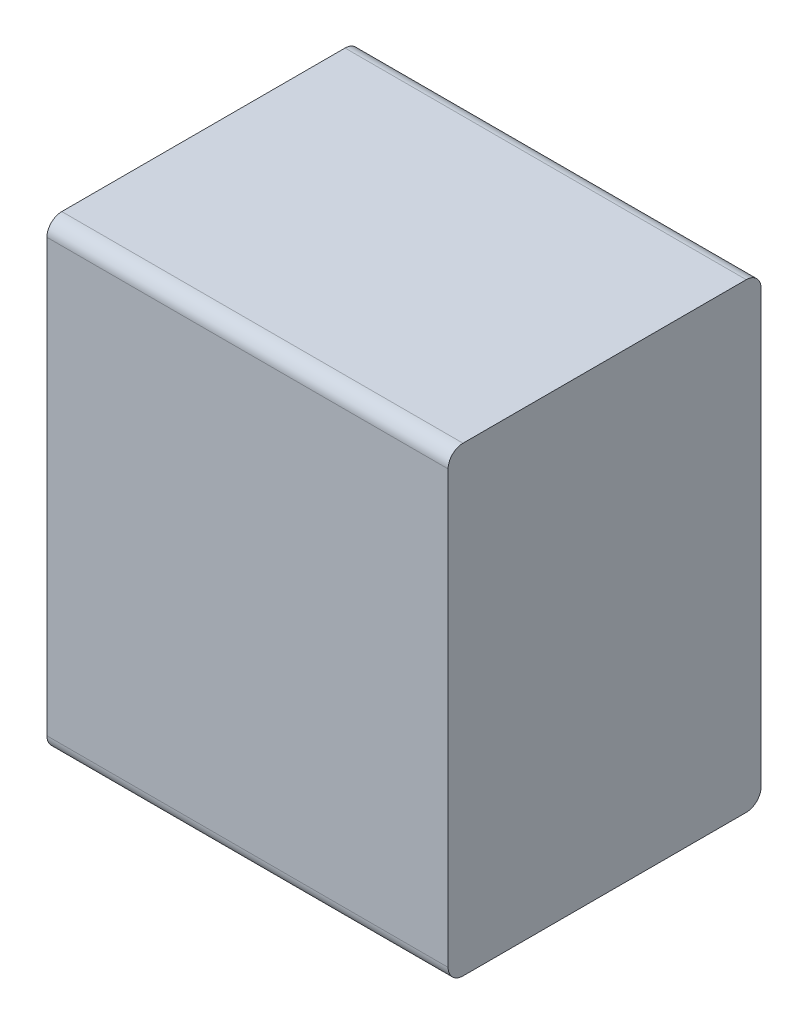
ISO-10303-21;
HEADER;
FILE_DESCRIPTION(('STEP AP214'),'2;1');
FILE_NAME('part.step','',(''),(''),'','','');
FILE_SCHEMA(('AUTOMOTIVE_DESIGN { 1 0 10303 214 1 1 1 1 }'));
ENDSEC;
DATA;
#1=APPLICATION_CONTEXT('core data for automotive mechanical design processes');
#2=APPLICATION_PROTOCOL_DEFINITION('international standard','automotive_design',2000,#1);
#3=PRODUCT_CONTEXT('',#1,'mechanical');
#4=PRODUCT('Part','Part','',(#3));
#5=PRODUCT_RELATED_PRODUCT_CATEGORY('part','',(#4));
#6=PRODUCT_DEFINITION_FORMATION('','',#4);
#7=PRODUCT_DEFINITION_CONTEXT('part definition',#1,'design');
#8=PRODUCT_DEFINITION('design','',#6,#7);
#9=PRODUCT_DEFINITION_SHAPE('','',#8);
#10=(LENGTH_UNIT() NAMED_UNIT(*) SI_UNIT(.MILLI.,.METRE.));
#11=(NAMED_UNIT(*) PLANE_ANGLE_UNIT() SI_UNIT($,.RADIAN.));
#12=(NAMED_UNIT(*) SI_UNIT($,.STERADIAN.) SOLID_ANGLE_UNIT());
#13=UNCERTAINTY_MEASURE_WITH_UNIT(LENGTH_MEASURE(1.E-05),#10,'distance_accuracy_value','');
#14=(GEOMETRIC_REPRESENTATION_CONTEXT(3) GLOBAL_UNCERTAINTY_ASSIGNED_CONTEXT((#13)) GLOBAL_UNIT_ASSIGNED_CONTEXT((#10,
#11,#12)) REPRESENTATION_CONTEXT('',''));
#15=CARTESIAN_POINT('',(0.,0.,0.));
#16=DIRECTION('',(0.,0.,1.));
#17=DIRECTION('',(1.,0.,0.));
#18=AXIS2_PLACEMENT_3D('',#15,#16,#17);
#19=CARTESIAN_POINT('',(0.5,-0.575,0.05));
#20=DIRECTION('',(1.,0.,0.));
#21=DIRECTION('',(0.,1.,0.));
#22=AXIS2_PLACEMENT_3D('',#19,#20,#21);
#23=PLANE('',#22);
#24=DIRECTION('',(0.,0.,1.));
#25=VECTOR('',#24,1.);
#26=CARTESIAN_POINT('',(0.5,-0.575,0.05));
#27=LINE('',#26,#25);
#28=CARTESIAN_POINT('',(0.5,-0.575,0.087));
#29=VERTEX_POINT('',#28);
#30=CARTESIAN_POINT('',(0.5,-0.575,0.793));
#31=VERTEX_POINT('',#30);
#32=EDGE_CURVE('E132',#29,#31,#27,.T.);
#33=ORIENTED_EDGE('',*,*,#32,.F.);
#34=CARTESIAN_POINT('',(0.5,-0.538,0.087));
#35=DIRECTION('',(1.,0.,0.));
#36=DIRECTION('',(0.,0.,1.));
#37=AXIS2_PLACEMENT_3D('',#34,#35,#36);
#38=CIRCLE('',#37,0.037);
#39=CARTESIAN_POINT('',(0.5,-0.538,0.05));
#40=VERTEX_POINT('',#39);
#41=EDGE_CURVE('E131',#29,#40,#38,.T.);
#42=ORIENTED_EDGE('',*,*,#41,.T.);
#43=DIRECTION('',(0.,1.,0.));
#44=VECTOR('',#43,1.);
#45=CARTESIAN_POINT('',(0.5,-0.575,0.05));
#46=LINE('',#45,#44);
#47=CARTESIAN_POINT('',(0.5,0.538,0.05));
#48=VERTEX_POINT('',#47);
#49=EDGE_CURVE('E105',#40,#48,#46,.T.);
#50=ORIENTED_EDGE('',*,*,#49,.T.);
#51=CARTESIAN_POINT('',(0.5,0.538,0.087));
#52=DIRECTION('',(-1.,0.,0.));
#53=DIRECTION('',(0.,0.,1.));
#54=AXIS2_PLACEMENT_3D('',#51,#52,#53);
#55=CIRCLE('',#54,0.037);
#56=CARTESIAN_POINT('',(0.5,0.575,0.087));
#57=VERTEX_POINT('',#56);
#58=EDGE_CURVE('E102',#57,#48,#55,.T.);
#59=ORIENTED_EDGE('',*,*,#58,.F.);
#60=DIRECTION('',(0.,0.,1.));
#61=VECTOR('',#60,1.);
#62=CARTESIAN_POINT('',(0.5,0.575,0.05));
#63=LINE('',#62,#61);
#64=CARTESIAN_POINT('',(0.5,0.575,0.793));
#65=VERTEX_POINT('',#64);
#66=EDGE_CURVE('E11',#57,#65,#63,.T.);
#67=ORIENTED_EDGE('',*,*,#66,.T.);
#68=CARTESIAN_POINT('',(0.5,0.538,0.793));
#69=DIRECTION('',(1.,0.,0.));
#70=DIRECTION('',(0.,0.,1.));
#71=AXIS2_PLACEMENT_3D('',#68,#69,#70);
#72=CIRCLE('',#71,0.037);
#73=CARTESIAN_POINT('',(0.5,0.538,0.83));
#74=VERTEX_POINT('',#73);
#75=EDGE_CURVE('E140',#65,#74,#72,.T.);
#76=ORIENTED_EDGE('',*,*,#75,.T.);
#77=DIRECTION('',(0.,1.,0.));
#78=VECTOR('',#77,1.);
#79=CARTESIAN_POINT('',(0.5,-0.575,0.83));
#80=LINE('',#79,#78);
#81=CARTESIAN_POINT('',(0.5,-0.538,0.83));
#82=VERTEX_POINT('',#81);
#83=EDGE_CURVE('E138',#82,#74,#80,.T.);
#84=ORIENTED_EDGE('',*,*,#83,.F.);
#85=CARTESIAN_POINT('',(0.5,-0.538,0.793));
#86=DIRECTION('',(-1.,0.,0.));
#87=DIRECTION('',(0.,0.,1.));
#88=AXIS2_PLACEMENT_3D('',#85,#86,#87);
#89=CIRCLE('',#88,0.037);
#90=EDGE_CURVE('E153',#31,#82,#89,.T.);
#91=ORIENTED_EDGE('',*,*,#90,.F.);
#92=EDGE_LOOP('',(#33,#42,#50,#59,#67,#76,#84,#91));
#93=FACE_BOUND('',#92,.T.);
#94=ADVANCED_FACE('F16',(#93),#23,.T.);
#95=CARTESIAN_POINT('',(-0.5,0.575,0.05));
#96=DIRECTION('',(0.,1.,0.));
#97=DIRECTION('',(1.,0.,0.));
#98=AXIS2_PLACEMENT_3D('',#95,#96,#97);
#99=PLANE('',#98);
#100=ORIENTED_EDGE('',*,*,#66,.F.);
#101=DIRECTION('',(1.,0.,0.));
#102=VECTOR('',#101,1.);
#103=CARTESIAN_POINT('',(-0.5,0.575,0.087));
#104=LINE('',#103,#102);
#105=CARTESIAN_POINT('',(-0.5,0.575,0.087));
#106=VERTEX_POINT('',#105);
#107=EDGE_CURVE('E137',#106,#57,#104,.T.);
#108=ORIENTED_EDGE('',*,*,#107,.F.);
#109=DIRECTION('',(0.,0.,1.));
#110=VECTOR('',#109,1.);
#111=CARTESIAN_POINT('',(-0.5,0.575,0.05));
#112=LINE('',#111,#110);
#113=CARTESIAN_POINT('',(-0.5,0.575,0.793));
#114=VERTEX_POINT('',#113);
#115=EDGE_CURVE('E120',#106,#114,#112,.T.);
#116=ORIENTED_EDGE('',*,*,#115,.T.);
#117=DIRECTION('',(1.,0.,0.));
#118=VECTOR('',#117,1.);
#119=CARTESIAN_POINT('',(-0.5,0.575,0.793));
#120=LINE('',#119,#118);
#121=EDGE_CURVE('E27',#114,#65,#120,.T.);
#122=ORIENTED_EDGE('',*,*,#121,.T.);
#123=EDGE_LOOP('',(#100,#108,#116,#122));
#124=FACE_BOUND('',#123,.T.);
#125=ADVANCED_FACE('F196',(#124),#99,.T.);
#126=CARTESIAN_POINT('',(-0.5,0.538,0.793));
#127=DIRECTION('',(1.,0.,0.));
#128=DIRECTION('',(0.,1.,0.));
#129=AXIS2_PLACEMENT_3D('',#126,#127,#128);
#130=CYLINDRICAL_SURFACE('',#129,0.037);
#131=CARTESIAN_POINT('',(-0.5,0.538,0.793));
#132=DIRECTION('',(1.,0.,0.));
#133=DIRECTION('',(0.,0.,1.));
#134=AXIS2_PLACEMENT_3D('',#131,#132,#133);
#135=CIRCLE('',#134,0.037);
#136=CARTESIAN_POINT('',(-0.5,0.538,0.83));
#137=VERTEX_POINT('',#136);
#138=EDGE_CURVE('E20',#114,#137,#135,.T.);
#139=ORIENTED_EDGE('',*,*,#138,.T.);
#140=DIRECTION('',(1.,0.,0.));
#141=VECTOR('',#140,1.);
#142=CARTESIAN_POINT('',(-0.5,0.538,0.83));
#143=LINE('',#142,#141);
#144=EDGE_CURVE('E133',#137,#74,#143,.T.);
#145=ORIENTED_EDGE('',*,*,#144,.T.);
#146=ORIENTED_EDGE('',*,*,#75,.F.);
#147=ORIENTED_EDGE('',*,*,#121,.F.);
#148=EDGE_LOOP('',(#139,#145,#146,#147));
#149=FACE_BOUND('',#148,.T.);
#150=ADVANCED_FACE('F193',(#149),#130,.T.);
#151=CARTESIAN_POINT('',(-0.5,0.538,0.087));
#152=DIRECTION('',(1.,0.,0.));
#153=DIRECTION('',(0.,1.,0.));
#154=AXIS2_PLACEMENT_3D('',#151,#152,#153);
#155=CYLINDRICAL_SURFACE('',#154,0.037);
#156=ORIENTED_EDGE('',*,*,#107,.T.);
#157=ORIENTED_EDGE('',*,*,#58,.T.);
#158=DIRECTION('',(1.,0.,0.));
#159=VECTOR('',#158,1.);
#160=CARTESIAN_POINT('',(-0.5,0.538,0.05));
#161=LINE('',#160,#159);
#162=CARTESIAN_POINT('',(-0.5,0.538,0.05));
#163=VERTEX_POINT('',#162);
#164=EDGE_CURVE('E96',#163,#48,#161,.T.);
#165=ORIENTED_EDGE('',*,*,#164,.F.);
#166=CARTESIAN_POINT('',(-0.5,0.538,0.087));
#167=DIRECTION('',(-1.,0.,0.));
#168=DIRECTION('',(0.,0.,1.));
#169=AXIS2_PLACEMENT_3D('',#166,#167,#168);
#170=CIRCLE('',#169,0.037);
#171=EDGE_CURVE('E100',#106,#163,#170,.T.);
#172=ORIENTED_EDGE('',*,*,#171,.F.);
#173=EDGE_LOOP('',(#156,#157,#165,#172));
#174=FACE_BOUND('',#173,.T.);
#175=ADVANCED_FACE('F98',(#174),#155,.T.);
#176=CARTESIAN_POINT('',(-0.5,-0.575,0.83));
#177=DIRECTION('',(0.,0.,1.));
#178=DIRECTION('',(1.,0.,0.));
#179=AXIS2_PLACEMENT_3D('',#176,#177,#178);
#180=PLANE('',#179);
#181=DIRECTION('',(0.,1.,0.));
#182=VECTOR('',#181,1.);
#183=CARTESIAN_POINT('',(-0.5,-0.575,0.83));
#184=LINE('',#183,#182);
#185=CARTESIAN_POINT('',(-0.5,-0.538,0.83));
#186=VERTEX_POINT('',#185);
#187=EDGE_CURVE('E165',#186,#137,#184,.T.);
#188=ORIENTED_EDGE('',*,*,#187,.F.);
#189=DIRECTION('',(1.,0.,0.));
#190=VECTOR('',#189,1.);
#191=CARTESIAN_POINT('',(-0.5,-0.538,0.83));
#192=LINE('',#191,#190);
#193=EDGE_CURVE('E106',#186,#82,#192,.T.);
#194=ORIENTED_EDGE('',*,*,#193,.T.);
#195=ORIENTED_EDGE('',*,*,#83,.T.);
#196=ORIENTED_EDGE('',*,*,#144,.F.);
#197=EDGE_LOOP('',(#188,#194,#195,#196));
#198=FACE_BOUND('',#197,.T.);
#199=ADVANCED_FACE('F209',(#198),#180,.T.);
#200=CARTESIAN_POINT('',(-0.5,-0.575,0.05));
#201=DIRECTION('',(0.,0.,1.));
#202=DIRECTION('',(1.,0.,0.));
#203=AXIS2_PLACEMENT_3D('',#200,#201,#202);
#204=PLANE('',#203);
#205=ORIENTED_EDGE('',*,*,#164,.T.);
#206=ORIENTED_EDGE('',*,*,#49,.F.);
#207=DIRECTION('',(1.,0.,0.));
#208=VECTOR('',#207,1.);
#209=CARTESIAN_POINT('',(-0.5,-0.538,0.05));
#210=LINE('',#209,#208);
#211=CARTESIAN_POINT('',(-0.5,-0.538,0.05));
#212=VERTEX_POINT('',#211);
#213=EDGE_CURVE('E88',#212,#40,#210,.T.);
#214=ORIENTED_EDGE('',*,*,#213,.F.);
#215=DIRECTION('',(0.,1.,0.));
#216=VECTOR('',#215,1.);
#217=CARTESIAN_POINT('',(-0.5,-0.575,0.05));
#218=LINE('',#217,#216);
#219=EDGE_CURVE('E109',#212,#163,#218,.T.);
#220=ORIENTED_EDGE('',*,*,#219,.T.);
#221=EDGE_LOOP('',(#205,#206,#214,#220));
#222=FACE_BOUND('',#221,.T.);
#223=ADVANCED_FACE('F110',(#222),#204,.F.);
#224=CARTESIAN_POINT('',(-0.5,-0.538,0.793));
#225=DIRECTION('',(1.,0.,0.));
#226=DIRECTION('',(0.,-1.,0.));
#227=AXIS2_PLACEMENT_3D('',#224,#225,#226);
#228=CYLINDRICAL_SURFACE('',#227,0.037);
#229=DIRECTION('',(1.,0.,0.));
#230=VECTOR('',#229,1.);
#231=CARTESIAN_POINT('',(-0.5,-0.575,0.793));
#232=LINE('',#231,#230);
#233=CARTESIAN_POINT('',(-0.5,-0.575,0.793));
#234=VERTEX_POINT('',#233);
#235=EDGE_CURVE('E148',#234,#31,#232,.T.);
#236=ORIENTED_EDGE('',*,*,#235,.T.);
#237=ORIENTED_EDGE('',*,*,#90,.T.);
#238=ORIENTED_EDGE('',*,*,#193,.F.);
#239=CARTESIAN_POINT('',(-0.5,-0.538,0.793));
#240=DIRECTION('',(-1.,0.,0.));
#241=DIRECTION('',(0.,0.,1.));
#242=AXIS2_PLACEMENT_3D('',#239,#240,#241);
#243=CIRCLE('',#242,0.037);
#244=EDGE_CURVE('E162',#234,#186,#243,.T.);
#245=ORIENTED_EDGE('',*,*,#244,.F.);
#246=EDGE_LOOP('',(#236,#237,#238,#245));
#247=FACE_BOUND('',#246,.T.);
#248=ADVANCED_FACE('F207',(#247),#228,.T.);
#249=CARTESIAN_POINT('',(-0.5,-0.538,0.087));
#250=DIRECTION('',(1.,0.,0.));
#251=DIRECTION('',(0.,-1.,0.));
#252=AXIS2_PLACEMENT_3D('',#249,#250,#251);
#253=CYLINDRICAL_SURFACE('',#252,0.037);
#254=CARTESIAN_POINT('',(-0.5,-0.538,0.087));
#255=DIRECTION('',(1.,0.,0.));
#256=DIRECTION('',(0.,0.,1.));
#257=AXIS2_PLACEMENT_3D('',#254,#255,#256);
#258=CIRCLE('',#257,0.037);
#259=CARTESIAN_POINT('',(-0.5,-0.575,0.087));
#260=VERTEX_POINT('',#259);
#261=EDGE_CURVE('E114',#260,#212,#258,.T.);
#262=ORIENTED_EDGE('',*,*,#261,.T.);
#263=ORIENTED_EDGE('',*,*,#213,.T.);
#264=ORIENTED_EDGE('',*,*,#41,.F.);
#265=DIRECTION('',(1.,0.,0.));
#266=VECTOR('',#265,1.);
#267=CARTESIAN_POINT('',(-0.5,-0.575,0.087));
#268=LINE('',#267,#266);
#269=EDGE_CURVE('E145',#260,#29,#268,.T.);
#270=ORIENTED_EDGE('',*,*,#269,.F.);
#271=EDGE_LOOP('',(#262,#263,#264,#270));
#272=FACE_BOUND('',#271,.T.);
#273=ADVANCED_FACE('F18',(#272),#253,.T.);
#274=CARTESIAN_POINT('',(-0.5,-0.575,0.05));
#275=DIRECTION('',(0.,1.,0.));
#276=DIRECTION('',(1.,0.,0.));
#277=AXIS2_PLACEMENT_3D('',#274,#275,#276);
#278=PLANE('',#277);
#279=ORIENTED_EDGE('',*,*,#235,.F.);
#280=DIRECTION('',(0.,0.,1.));
#281=VECTOR('',#280,1.);
#282=CARTESIAN_POINT('',(-0.5,-0.575,0.05));
#283=LINE('',#282,#281);
#284=EDGE_CURVE('E144',#260,#234,#283,.T.);
#285=ORIENTED_EDGE('',*,*,#284,.F.);
#286=ORIENTED_EDGE('',*,*,#269,.T.);
#287=ORIENTED_EDGE('',*,*,#32,.T.);
#288=EDGE_LOOP('',(#279,#285,#286,#287));
#289=FACE_BOUND('',#288,.T.);
#290=ADVANCED_FACE('F223',(#289),#278,.F.);
#291=CARTESIAN_POINT('',(-0.5,-0.575,0.05));
#292=DIRECTION('',(1.,0.,0.));
#293=DIRECTION('',(0.,1.,0.));
#294=AXIS2_PLACEMENT_3D('',#291,#292,#293);
#295=PLANE('',#294);
#296=ORIENTED_EDGE('',*,*,#244,.T.);
#297=ORIENTED_EDGE('',*,*,#187,.T.);
#298=ORIENTED_EDGE('',*,*,#138,.F.);
#299=ORIENTED_EDGE('',*,*,#115,.F.);
#300=ORIENTED_EDGE('',*,*,#171,.T.);
#301=ORIENTED_EDGE('',*,*,#219,.F.);
#302=ORIENTED_EDGE('',*,*,#261,.F.);
#303=ORIENTED_EDGE('',*,*,#284,.T.);
#304=EDGE_LOOP('',(#296,#297,#298,#299,#300,#301,#302,#303));
#305=FACE_BOUND('',#304,.T.);
#306=ADVANCED_FACE('F117',(#305),#295,.F.);
#307=CLOSED_SHELL('',(#94,#125,#150,#175,#199,#223,#248,#273,#290,#306));
#308=MANIFOLD_SOLID_BREP('B1',#307);
#309=ADVANCED_BREP_SHAPE_REPRESENTATION('',(#18,#308),#14);
#310=SHAPE_DEFINITION_REPRESENTATION(#9,#309);
ENDSEC;
END-ISO-10303-21;
